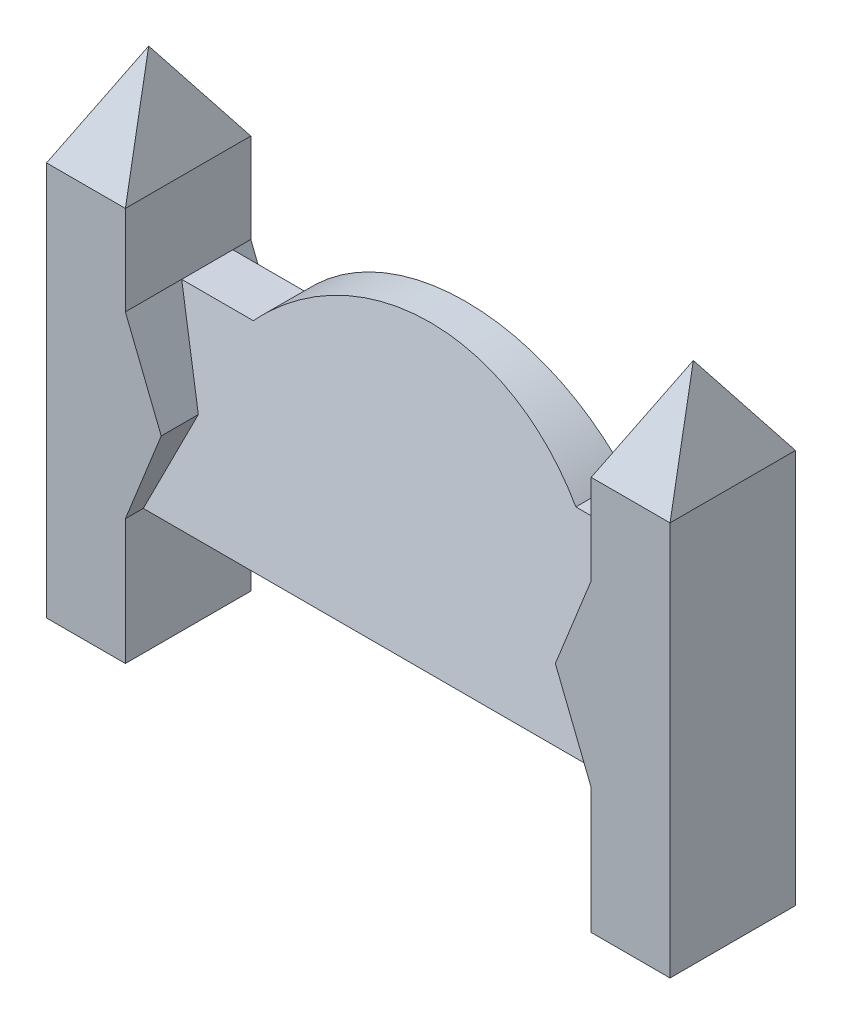
ISO-10303-21;
HEADER;
FILE_DESCRIPTION(('STEP AP214'),'2;1');
FILE_NAME('part.step','',(''),(''),'','','');
FILE_SCHEMA(('AUTOMOTIVE_DESIGN { 1 0 10303 214 1 1 1 1 }'));
ENDSEC;
DATA;
#1=APPLICATION_CONTEXT('core data for automotive mechanical design processes');
#2=APPLICATION_PROTOCOL_DEFINITION('international standard','automotive_design',2000,#1);
#3=PRODUCT_CONTEXT('',#1,'mechanical');
#4=PRODUCT('Part','Part','',(#3));
#5=PRODUCT_RELATED_PRODUCT_CATEGORY('part','',(#4));
#6=PRODUCT_DEFINITION_FORMATION('','',#4);
#7=PRODUCT_DEFINITION_CONTEXT('part definition',#1,'design');
#8=PRODUCT_DEFINITION('design','',#6,#7);
#9=PRODUCT_DEFINITION_SHAPE('','',#8);
#10=(LENGTH_UNIT() NAMED_UNIT(*) SI_UNIT(.MILLI.,.METRE.));
#11=(NAMED_UNIT(*) PLANE_ANGLE_UNIT() SI_UNIT($,.RADIAN.));
#12=(NAMED_UNIT(*) SI_UNIT($,.STERADIAN.) SOLID_ANGLE_UNIT());
#13=UNCERTAINTY_MEASURE_WITH_UNIT(LENGTH_MEASURE(1.E-05),#10,'distance_accuracy_value','');
#14=(GEOMETRIC_REPRESENTATION_CONTEXT(3) GLOBAL_UNCERTAINTY_ASSIGNED_CONTEXT((#13)) GLOBAL_UNIT_ASSIGNED_CONTEXT((#10,
#11,#12)) REPRESENTATION_CONTEXT('',''));
#15=CARTESIAN_POINT('',(0.,0.,0.));
#16=DIRECTION('',(0.,0.,1.));
#17=DIRECTION('',(1.,0.,0.));
#18=AXIS2_PLACEMENT_3D('',#15,#16,#17);
#19=CARTESIAN_POINT('',(1520.,1050.,50.));
#20=DIRECTION('',(0.,0.,-1.));
#21=DIRECTION('',(0.,1.,0.));
#22=AXIS2_PLACEMENT_3D('',#19,#20,#21);
#23=PLANE('',#22);
#24=CARTESIAN_POINT('',(870.,443.749999999999,50.));
#25=DIRECTION('',(0.,0.,-1.));
#26=DIRECTION('',(0.,1.,0.));
#27=AXIS2_PLACEMENT_3D('',#24,#25,#26);
#28=CIRCLE('',#27,606.250000000001);
#29=CARTESIAN_POINT('',(420.,850.,50.));
#30=VERTEX_POINT('',#29);
#31=CARTESIAN_POINT('',(1320.,850.,50.));
#32=VERTEX_POINT('',#31);
#33=EDGE_CURVE('E641',#30,#32,#28,.T.);
#34=ORIENTED_EDGE('',*,*,#33,.T.);
#35=DIRECTION('',(1.,0.,0.));
#36=VECTOR('',#35,1.);
#37=CARTESIAN_POINT('',(1520.,850.,50.));
#38=LINE('',#37,#36);
#39=CARTESIAN_POINT('',(1520.,850.,50.));
#40=VERTEX_POINT('',#39);
#41=EDGE_CURVE('E665',#32,#40,#38,.T.);
#42=ORIENTED_EDGE('',*,*,#41,.T.);
#43=DIRECTION('',(-0.371390676354104,-0.928476690885259,0.));
#44=VECTOR('',#43,1.);
#45=CARTESIAN_POINT('',(1588.96551724138,1022.41379310345,50.));
#46=LINE('',#45,#44);
#47=CARTESIAN_POINT('',(1420.,600.,50.));
#48=VERTEX_POINT('',#47);
#49=EDGE_CURVE('E247',#40,#48,#46,.T.);
#50=ORIENTED_EDGE('',*,*,#49,.T.);
#51=DIRECTION('',(0.371390676354104,-0.928476690885259,0.));
#52=VECTOR('',#51,1.);
#53=CARTESIAN_POINT('',(1278.62068965517,953.448275862069,50.));
#54=LINE('',#53,#52);
#55=CARTESIAN_POINT('',(1520.,350.,50.));
#56=VERTEX_POINT('',#55);
#57=EDGE_CURVE('E241',#48,#56,#54,.T.);
#58=ORIENTED_EDGE('',*,*,#57,.T.);
#59=DIRECTION('',(-1.,0.,0.));
#60=VECTOR('',#59,1.);
#61=CARTESIAN_POINT('',(1520.,350.,50.0000000000001));
#62=LINE('',#61,#60);
#63=CARTESIAN_POINT('',(220.,350.,50.0000000000001));
#64=VERTEX_POINT('',#63);
#65=EDGE_CURVE('E254',#56,#64,#62,.T.);
#66=ORIENTED_EDGE('',*,*,#65,.T.);
#67=DIRECTION('',(-0.371390676354104,-0.928476690885259,0.));
#68=VECTOR('',#67,1.);
#69=CARTESIAN_POINT('',(320.,600.,50.));
#70=LINE('',#69,#68);
#71=CARTESIAN_POINT('',(320.,600.,50.));
#72=VERTEX_POINT('',#71);
#73=EDGE_CURVE('E268',#72,#64,#70,.T.);
#74=ORIENTED_EDGE('',*,*,#73,.F.);
#75=DIRECTION('',(0.371390676354104,-0.928476690885259,0.));
#76=VECTOR('',#75,1.);
#77=CARTESIAN_POINT('',(220.,850.,50.));
#78=LINE('',#77,#76);
#79=CARTESIAN_POINT('',(220.,850.,50.));
#80=VERTEX_POINT('',#79);
#81=EDGE_CURVE('E265',#80,#72,#78,.T.);
#82=ORIENTED_EDGE('',*,*,#81,.F.);
#83=DIRECTION('',(1.,0.,0.));
#84=VECTOR('',#83,1.);
#85=CARTESIAN_POINT('',(1520.,850.,50.));
#86=LINE('',#85,#84);
#87=EDGE_CURVE('E355',#80,#30,#86,.T.);
#88=ORIENTED_EDGE('',*,*,#87,.T.);
#89=EDGE_LOOP('',(#34,#42,#50,#58,#66,#74,#82,#88));
#90=FACE_BOUND('',#89,.T.);
#91=ADVANCED_FACE('F38',(#90),#23,.T.);
#92=CARTESIAN_POINT('',(1520.,350.,300.));
#93=DIRECTION('',(0.,0.209529088730874,0.977802414077409));
#94=DIRECTION('',(0.,-0.97780241407741,0.209529088730874));
#95=AXIS2_PLACEMENT_3D('',#92,#93,#94);
#96=PLANE('',#95);
#97=DIRECTION('',(0.364251237872651,0.910628094681627,-0.195134591717492));
#98=VECTOR('',#97,1.);
#99=CARTESIAN_POINT('',(1346.53579285835,416.339482145879,285.784396683026));
#100=LINE('',#99,#98);
#101=CARTESIAN_POINT('',(1420.,600.,246.428571428571));
#102=VERTEX_POINT('',#101);
#103=CARTESIAN_POINT('',(1520.,850.,192.857142857143));
#104=VERTEX_POINT('',#103);
#105=EDGE_CURVE('E244',#102,#104,#100,.T.);
#106=ORIENTED_EDGE('',*,*,#105,.T.);
#107=DIRECTION('',(-1.,0.,0.));
#108=VECTOR('',#107,1.);
#109=CARTESIAN_POINT('',(1520.,850.,192.857142857143));
#110=LINE('',#109,#108);
#111=CARTESIAN_POINT('',(1320.,850.,192.857142857143));
#112=VERTEX_POINT('',#111);
#113=EDGE_CURVE('E663',#104,#112,#110,.T.);
#114=ORIENTED_EDGE('',*,*,#113,.T.);
#115=CARTESIAN_POINT('',(870.,443.749999999999,279.910714285714));
#116=DIRECTION('',(0.,0.209529088730874,0.977802414077409));
#117=DIRECTION('',(0.,0.97780241407741,-0.209529088730874));
#118=AXIS2_PLACEMENT_3D('',#115,#116,#117);
#119=ELLIPSE('',#118,620.012787115093,606.250000000001);
#120=CARTESIAN_POINT('',(420.,850.,192.857142857143));
#121=VERTEX_POINT('',#120);
#122=EDGE_CURVE('E640',#112,#121,#119,.T.);
#123=ORIENTED_EDGE('',*,*,#122,.T.);
#124=DIRECTION('',(-1.,0.,0.));
#125=VECTOR('',#124,1.);
#126=CARTESIAN_POINT('',(1520.,850.,192.857142857143));
#127=LINE('',#126,#125);
#128=CARTESIAN_POINT('',(220.,850.,192.857142857143));
#129=VERTEX_POINT('',#128);
#130=EDGE_CURVE('E628',#121,#129,#127,.T.);
#131=ORIENTED_EDGE('',*,*,#130,.T.);
#132=DIRECTION('',(-0.364251237872651,0.910628094681627,-0.195134591717492));
#133=VECTOR('',#132,1.);
#134=CARTESIAN_POINT('',(231.169402606194,822.076493484515,198.840751396175));
#135=LINE('',#134,#133);
#136=CARTESIAN_POINT('',(320.,600.,246.428571428571));
#137=VERTEX_POINT('',#136);
#138=EDGE_CURVE('E258',#137,#129,#135,.T.);
#139=ORIENTED_EDGE('',*,*,#138,.F.);
#140=DIRECTION('',(0.364251237872651,0.910628094681627,-0.195134591717492));
#141=VECTOR('',#140,1.);
#142=CARTESIAN_POINT('',(312.638348282281,581.595870705703,250.372313420206));
#143=LINE('',#142,#141);
#144=CARTESIAN_POINT('',(220.,350.,300.));
#145=VERTEX_POINT('',#144);
#146=EDGE_CURVE('E262',#145,#137,#143,.T.);
#147=ORIENTED_EDGE('',*,*,#146,.F.);
#148=DIRECTION('',(-1.,0.,0.));
#149=VECTOR('',#148,1.);
#150=CARTESIAN_POINT('',(1520.,350.,300.));
#151=LINE('',#150,#149);
#152=CARTESIAN_POINT('',(1520.,350.,300.));
#153=VERTEX_POINT('',#152);
#154=EDGE_CURVE('E255',#153,#145,#151,.T.);
#155=ORIENTED_EDGE('',*,*,#154,.F.);
#156=DIRECTION('',(-0.364251237872651,0.910628094681627,-0.195134591717492));
#157=VECTOR('',#156,1.);
#158=CARTESIAN_POINT('',(1520.,350.,300.));
#159=LINE('',#158,#157);
#160=EDGE_CURVE('E238',#153,#102,#159,.T.);
#161=ORIENTED_EDGE('',*,*,#160,.T.);
#162=EDGE_LOOP('',(#106,#114,#123,#131,#139,#147,#155,#161));
#163=FACE_BOUND('',#162,.T.);
#164=ADVANCED_FACE('F409',(#163),#96,.T.);
#165=CARTESIAN_POINT('',(320.,600.,350.));
#166=DIRECTION('',(-0.928476690885259,0.371390676354104,0.));
#167=DIRECTION('',(-0.371390676354104,-0.928476690885259,0.));
#168=AXIS2_PLACEMENT_3D('',#165,#166,#167);
#169=PLANE('',#168);
#170=DIRECTION('',(0.,0.,-1.));
#171=VECTOR('',#170,1.);
#172=CARTESIAN_POINT('',(320.,600.,350.));
#173=LINE('',#172,#171);
#174=CARTESIAN_POINT('',(320.,600.,0.));
#175=VERTEX_POINT('',#174);
#176=EDGE_CURVE('E297',#72,#175,#173,.T.);
#177=ORIENTED_EDGE('',*,*,#176,.F.);
#178=ORIENTED_EDGE('',*,*,#73,.T.);
#179=DIRECTION('',(0.,0.,-1.));
#180=VECTOR('',#179,1.);
#181=CARTESIAN_POINT('',(220.,350.,350.));
#182=LINE('',#181,#180);
#183=CARTESIAN_POINT('',(220.,350.,0.));
#184=VERTEX_POINT('',#183);
#185=EDGE_CURVE('E302',#64,#184,#182,.T.);
#186=ORIENTED_EDGE('',*,*,#185,.T.);
#187=DIRECTION('',(0.371390676354104,0.928476690885259,0.));
#188=VECTOR('',#187,1.);
#189=CARTESIAN_POINT('',(320.,600.,0.));
#190=LINE('',#189,#188);
#191=EDGE_CURVE('E277',#184,#175,#190,.T.);
#192=ORIENTED_EDGE('',*,*,#191,.T.);
#193=EDGE_LOOP('',(#177,#178,#186,#192));
#194=FACE_BOUND('',#193,.T.);
#195=ADVANCED_FACE('F415',(#194),#169,.F.);
#196=CARTESIAN_POINT('',(220.,850.,350.));
#197=DIRECTION('',(-0.928476690885259,-0.371390676354104,0.));
#198=DIRECTION('',(0.371390676354104,-0.928476690885259,0.));
#199=AXIS2_PLACEMENT_3D('',#196,#197,#198);
#200=PLANE('',#199);
#201=DIRECTION('',(0.,0.,-1.));
#202=VECTOR('',#201,1.);
#203=CARTESIAN_POINT('',(220.,850.,350.));
#204=LINE('',#203,#202);
#205=CARTESIAN_POINT('',(220.,850.,0.));
#206=VERTEX_POINT('',#205);
#207=EDGE_CURVE('E298',#80,#206,#204,.T.);
#208=ORIENTED_EDGE('',*,*,#207,.F.);
#209=ORIENTED_EDGE('',*,*,#81,.T.);
#210=ORIENTED_EDGE('',*,*,#176,.T.);
#211=DIRECTION('',(-0.371390676354104,0.928476690885259,0.));
#212=VECTOR('',#211,1.);
#213=CARTESIAN_POINT('',(220.,850.,0.));
#214=LINE('',#213,#212);
#215=EDGE_CURVE('E280',#175,#206,#214,.T.);
#216=ORIENTED_EDGE('',*,*,#215,.T.);
#217=EDGE_LOOP('',(#208,#209,#210,#216));
#218=FACE_BOUND('',#217,.T.);
#219=ADVANCED_FACE('F436',(#218),#200,.F.);
#220=CARTESIAN_POINT('',(0.,0.,350.));
#221=DIRECTION('',(1.,0.,0.));
#222=DIRECTION('',(0.,0.,-1.));
#223=AXIS2_PLACEMENT_3D('',#220,#221,#222);
#224=PLANE('',#223);
#225=DIRECTION('',(0.,-1.,0.));
#226=VECTOR('',#225,1.);
#227=CARTESIAN_POINT('',(0.,0.,0.));
#228=LINE('',#227,#226);
#229=CARTESIAN_POINT('',(0.,1100.,0.));
#230=VERTEX_POINT('',#229);
#231=CARTESIAN_POINT('',(0.,0.,0.));
#232=VERTEX_POINT('',#231);
#233=EDGE_CURVE('E271',#230,#232,#228,.T.);
#234=ORIENTED_EDGE('',*,*,#233,.T.);
#235=DIRECTION('',(0.,0.,-1.));
#236=VECTOR('',#235,1.);
#237=CARTESIAN_POINT('',(0.,0.,350.));
#238=LINE('',#237,#236);
#239=CARTESIAN_POINT('',(0.,0.,350.));
#240=VERTEX_POINT('',#239);
#241=EDGE_CURVE('E12',#240,#232,#238,.T.);
#242=ORIENTED_EDGE('',*,*,#241,.F.);
#243=DIRECTION('',(0.,-1.,0.));
#244=VECTOR('',#243,1.);
#245=CARTESIAN_POINT('',(0.,0.,350.));
#246=LINE('',#245,#244);
#247=CARTESIAN_POINT('',(0.,1100.,350.));
#248=VERTEX_POINT('',#247);
#249=EDGE_CURVE('E287',#248,#240,#246,.T.);
#250=ORIENTED_EDGE('',*,*,#249,.F.);
#251=DIRECTION('',(0.,0.,-1.));
#252=VECTOR('',#251,1.);
#253=CARTESIAN_POINT('',(0.,1100.,350.));
#254=LINE('',#253,#252);
#255=EDGE_CURVE('E313',#248,#230,#254,.T.);
#256=ORIENTED_EDGE('',*,*,#255,.T.);
#257=EDGE_LOOP('',(#234,#242,#250,#256));
#258=FACE_BOUND('',#257,.T.);
#259=ADVANCED_FACE('F40',(#258),#224,.F.);
#260=CARTESIAN_POINT('',(0.,0.,350.));
#261=DIRECTION('',(0.,1.,0.));
#262=DIRECTION('',(0.,0.,1.));
#263=AXIS2_PLACEMENT_3D('',#260,#261,#262);
#264=PLANE('',#263);
#265=DIRECTION('',(1.,0.,0.));
#266=VECTOR('',#265,1.);
#267=CARTESIAN_POINT('',(0.,0.,0.));
#268=LINE('',#267,#266);
#269=CARTESIAN_POINT('',(220.,0.,0.));
#270=VERTEX_POINT('',#269);
#271=EDGE_CURVE('E272',#232,#270,#268,.T.);
#272=ORIENTED_EDGE('',*,*,#271,.T.);
#273=DIRECTION('',(0.,0.,-1.));
#274=VECTOR('',#273,1.);
#275=CARTESIAN_POINT('',(220.,0.,350.));
#276=LINE('',#275,#274);
#277=CARTESIAN_POINT('',(220.,0.,350.));
#278=VERTEX_POINT('',#277);
#279=EDGE_CURVE('E48',#278,#270,#276,.T.);
#280=ORIENTED_EDGE('',*,*,#279,.F.);
#281=DIRECTION('',(1.,0.,0.));
#282=VECTOR('',#281,1.);
#283=CARTESIAN_POINT('',(0.,0.,350.));
#284=LINE('',#283,#282);
#285=EDGE_CURVE('E284',#240,#278,#284,.T.);
#286=ORIENTED_EDGE('',*,*,#285,.F.);
#287=ORIENTED_EDGE('',*,*,#241,.T.);
#288=EDGE_LOOP('',(#272,#280,#286,#287));
#289=FACE_BOUND('',#288,.T.);
#290=ADVANCED_FACE('F442',(#289),#264,.F.);
#291=CARTESIAN_POINT('',(220.,0.,350.));
#292=DIRECTION('',(-1.,0.,0.));
#293=DIRECTION('',(0.,0.,1.));
#294=AXIS2_PLACEMENT_3D('',#291,#292,#293);
#295=PLANE('',#294);
#296=DIRECTION('',(0.,1.,0.));
#297=VECTOR('',#296,1.);
#298=CARTESIAN_POINT('',(220.,0.,0.));
#299=LINE('',#298,#297);
#300=EDGE_CURVE('E274',#270,#184,#299,.T.);
#301=ORIENTED_EDGE('',*,*,#300,.T.);
#302=ORIENTED_EDGE('',*,*,#185,.F.);
#303=DIRECTION('',(0.,0.,1.));
#304=VECTOR('',#303,1.);
#305=CARTESIAN_POINT('',(220.,350.,50.0000000000001));
#306=LINE('',#305,#304);
#307=EDGE_CURVE('E250',#64,#145,#306,.T.);
#308=ORIENTED_EDGE('',*,*,#307,.T.);
#309=CARTESIAN_POINT('',(220.,350.,350.));
#310=VERTEX_POINT('',#309);
#311=EDGE_CURVE('E303',#310,#145,#182,.T.);
#312=ORIENTED_EDGE('',*,*,#311,.F.);
#313=DIRECTION('',(0.,1.,0.));
#314=VECTOR('',#313,1.);
#315=CARTESIAN_POINT('',(220.,0.,350.));
#316=LINE('',#315,#314);
#317=EDGE_CURVE('E286',#278,#310,#316,.T.);
#318=ORIENTED_EDGE('',*,*,#317,.F.);
#319=ORIENTED_EDGE('',*,*,#279,.T.);
#320=EDGE_LOOP('',(#301,#302,#308,#312,#318,#319));
#321=FACE_BOUND('',#320,.T.);
#322=ADVANCED_FACE('F439',(#321),#295,.F.);
#323=ORIENTED_EDGE('',*,*,#311,.T.);
#324=ORIENTED_EDGE('',*,*,#146,.T.);
#325=CARTESIAN_POINT('',(320.,600.,350.));
#326=VERTEX_POINT('',#325);
#327=EDGE_CURVE('E299',#326,#137,#173,.T.);
#328=ORIENTED_EDGE('',*,*,#327,.F.);
#329=DIRECTION('',(0.371390676354104,0.928476690885259,0.));
#330=VECTOR('',#329,1.);
#331=CARTESIAN_POINT('',(320.,600.,350.));
#332=LINE('',#331,#330);
#333=EDGE_CURVE('E289',#310,#326,#332,.T.);
#334=ORIENTED_EDGE('',*,*,#333,.F.);
#335=EDGE_LOOP('',(#323,#324,#328,#334));
#336=FACE_BOUND('',#335,.T.);
#337=ADVANCED_FACE('F434',(#336),#169,.F.);
#338=ORIENTED_EDGE('',*,*,#327,.T.);
#339=ORIENTED_EDGE('',*,*,#138,.T.);
#340=CARTESIAN_POINT('',(220.,850.,350.));
#341=VERTEX_POINT('',#340);
#342=EDGE_CURVE('E294',#341,#129,#204,.T.);
#343=ORIENTED_EDGE('',*,*,#342,.F.);
#344=DIRECTION('',(-0.371390676354104,0.928476690885259,0.));
#345=VECTOR('',#344,1.);
#346=CARTESIAN_POINT('',(220.,850.,350.));
#347=LINE('',#346,#345);
#348=EDGE_CURVE('E291',#326,#341,#347,.T.);
#349=ORIENTED_EDGE('',*,*,#348,.F.);
#350=EDGE_LOOP('',(#338,#339,#343,#349));
#351=FACE_BOUND('',#350,.T.);
#352=ADVANCED_FACE('F430',(#351),#200,.F.);
#353=CARTESIAN_POINT('',(220.,850.,350.));
#354=DIRECTION('',(-1.,0.,0.));
#355=DIRECTION('',(0.,0.,1.));
#356=AXIS2_PLACEMENT_3D('',#353,#354,#355);
#357=PLANE('',#356);
#358=DIRECTION('',(0.,0.,-1.));
#359=VECTOR('',#358,1.);
#360=CARTESIAN_POINT('',(220.,850.,350.));
#361=LINE('',#360,#359);
#362=EDGE_CURVE('E624',#129,#80,#361,.T.);
#363=ORIENTED_EDGE('',*,*,#362,.T.);
#364=ORIENTED_EDGE('',*,*,#207,.T.);
#365=DIRECTION('',(0.,1.,0.));
#366=VECTOR('',#365,1.);
#367=CARTESIAN_POINT('',(220.,850.,0.));
#368=LINE('',#367,#366);
#369=CARTESIAN_POINT('',(220.,1100.,0.));
#370=VERTEX_POINT('',#369);
#371=EDGE_CURVE('E283',#206,#370,#368,.T.);
#372=ORIENTED_EDGE('',*,*,#371,.T.);
#373=DIRECTION('',(0.,0.,1.));
#374=VECTOR('',#373,1.);
#375=CARTESIAN_POINT('',(220.,1100.,175.));
#376=LINE('',#375,#374);
#377=CARTESIAN_POINT('',(220.,1100.,350.));
#378=VERTEX_POINT('',#377);
#379=EDGE_CURVE('E315',#378,#370,#376,.F.);
#380=ORIENTED_EDGE('',*,*,#379,.F.);
#381=DIRECTION('',(0.,1.,0.));
#382=VECTOR('',#381,1.);
#383=CARTESIAN_POINT('',(220.,850.,350.));
#384=LINE('',#383,#382);
#385=EDGE_CURVE('E293',#341,#378,#384,.T.);
#386=ORIENTED_EDGE('',*,*,#385,.F.);
#387=ORIENTED_EDGE('',*,*,#342,.T.);
#388=EDGE_LOOP('',(#363,#364,#372,#380,#386,#387));
#389=FACE_BOUND('',#388,.T.);
#390=ADVANCED_FACE('F427',(#389),#357,.F.);
#391=CARTESIAN_POINT('',(0.,1100.,350.));
#392=DIRECTION('',(0.,0.,-1.));
#393=DIRECTION('',(-1.,0.,0.));
#394=AXIS2_PLACEMENT_3D('',#391,#392,#393);
#395=PLANE('',#394);
#396=ORIENTED_EDGE('',*,*,#249,.T.);
#397=ORIENTED_EDGE('',*,*,#285,.T.);
#398=ORIENTED_EDGE('',*,*,#317,.T.);
#399=ORIENTED_EDGE('',*,*,#333,.T.);
#400=ORIENTED_EDGE('',*,*,#348,.T.);
#401=ORIENTED_EDGE('',*,*,#385,.T.);
#402=DIRECTION('',(-1.,0.,0.));
#403=VECTOR('',#402,1.);
#404=CARTESIAN_POINT('',(0.,1100.,350.));
#405=LINE('',#404,#403);
#406=EDGE_CURVE('E57',#378,#248,#405,.T.);
#407=ORIENTED_EDGE('',*,*,#406,.T.);
#408=EDGE_LOOP('',(#396,#397,#398,#399,#400,#401,#407));
#409=FACE_BOUND('',#408,.T.);
#410=ADVANCED_FACE('F424',(#409),#395,.F.);
#411=CARTESIAN_POINT('',(0.,1100.,0.));
#412=DIRECTION('',(0.,0.,-1.));
#413=DIRECTION('',(-1.,0.,0.));
#414=AXIS2_PLACEMENT_3D('',#411,#412,#413);
#415=PLANE('',#414);
#416=ORIENTED_EDGE('',*,*,#233,.F.);
#417=DIRECTION('',(1.,0.,0.));
#418=VECTOR('',#417,1.);
#419=CARTESIAN_POINT('',(0.,1100.,0.));
#420=LINE('',#419,#418);
#421=EDGE_CURVE('E169',#370,#230,#420,.F.);
#422=ORIENTED_EDGE('',*,*,#421,.F.);
#423=ORIENTED_EDGE('',*,*,#371,.F.);
#424=ORIENTED_EDGE('',*,*,#215,.F.);
#425=ORIENTED_EDGE('',*,*,#191,.F.);
#426=ORIENTED_EDGE('',*,*,#300,.F.);
#427=ORIENTED_EDGE('',*,*,#271,.F.);
#428=EDGE_LOOP('',(#416,#422,#423,#424,#425,#426,#427));
#429=FACE_BOUND('',#428,.T.);
#430=ADVANCED_FACE('F421',(#429),#415,.T.);
#431=CARTESIAN_POINT('',(1520.,350.,50.0000000000001));
#432=DIRECTION('',(0.,-1.,0.));
#433=DIRECTION('',(0.,0.,-1.));
#434=AXIS2_PLACEMENT_3D('',#431,#432,#433);
#435=PLANE('',#434);
#436=ORIENTED_EDGE('',*,*,#307,.F.);
#437=ORIENTED_EDGE('',*,*,#65,.F.);
#438=DIRECTION('',(0.,0.,1.));
#439=VECTOR('',#438,1.);
#440=CARTESIAN_POINT('',(1520.,350.,50.0000000000001));
#441=LINE('',#440,#439);
#442=EDGE_CURVE('E196',#56,#153,#441,.T.);
#443=ORIENTED_EDGE('',*,*,#442,.T.);
#444=ORIENTED_EDGE('',*,*,#154,.T.);
#445=EDGE_LOOP('',(#436,#437,#443,#444));
#446=FACE_BOUND('',#445,.T.);
#447=ADVANCED_FACE('F420',(#446),#435,.T.);
#448=CARTESIAN_POINT('',(1520.,850.,350.));
#449=DIRECTION('',(0.928476690885259,-0.371390676354104,0.));
#450=DIRECTION('',(0.371390676354104,0.928476690885259,0.));
#451=AXIS2_PLACEMENT_3D('',#448,#449,#450);
#452=PLANE('',#451);
#453=ORIENTED_EDGE('',*,*,#49,.F.);
#454=DIRECTION('',(0.,0.,-1.));
#455=VECTOR('',#454,1.);
#456=CARTESIAN_POINT('',(1520.,850.,350.));
#457=LINE('',#456,#455);
#458=CARTESIAN_POINT('',(1520.,850.,0.));
#459=VERTEX_POINT('',#458);
#460=EDGE_CURVE('E233',#40,#459,#457,.T.);
#461=ORIENTED_EDGE('',*,*,#460,.T.);
#462=DIRECTION('',(-0.371390676354104,-0.928476690885259,0.));
#463=VECTOR('',#462,1.);
#464=CARTESIAN_POINT('',(1520.,850.,0.));
#465=LINE('',#464,#463);
#466=CARTESIAN_POINT('',(1420.,600.,0.));
#467=VERTEX_POINT('',#466);
#468=EDGE_CURVE('E210',#459,#467,#465,.T.);
#469=ORIENTED_EDGE('',*,*,#468,.T.);
#470=DIRECTION('',(0.,0.,-1.));
#471=VECTOR('',#470,1.);
#472=CARTESIAN_POINT('',(1420.,600.,350.));
#473=LINE('',#472,#471);
#474=EDGE_CURVE('E206',#48,#467,#473,.T.);
#475=ORIENTED_EDGE('',*,*,#474,.F.);
#476=EDGE_LOOP('',(#453,#461,#469,#475));
#477=FACE_BOUND('',#476,.T.);
#478=ADVANCED_FACE('F366',(#477),#452,.F.);
#479=CARTESIAN_POINT('',(1420.,600.,350.));
#480=DIRECTION('',(0.928476690885259,0.371390676354104,0.));
#481=DIRECTION('',(-0.371390676354104,0.928476690885259,0.));
#482=AXIS2_PLACEMENT_3D('',#479,#480,#481);
#483=PLANE('',#482);
#484=ORIENTED_EDGE('',*,*,#57,.F.);
#485=ORIENTED_EDGE('',*,*,#474,.T.);
#486=DIRECTION('',(0.371390676354104,-0.928476690885259,0.));
#487=VECTOR('',#486,1.);
#488=CARTESIAN_POINT('',(1420.,600.,0.));
#489=LINE('',#488,#487);
#490=CARTESIAN_POINT('',(1520.,350.,0.));
#491=VERTEX_POINT('',#490);
#492=EDGE_CURVE('E203',#467,#491,#489,.T.);
#493=ORIENTED_EDGE('',*,*,#492,.T.);
#494=DIRECTION('',(0.,0.,-1.));
#495=VECTOR('',#494,1.);
#496=CARTESIAN_POINT('',(1520.,350.,350.));
#497=LINE('',#496,#495);
#498=EDGE_CURVE('E189',#56,#491,#497,.T.);
#499=ORIENTED_EDGE('',*,*,#498,.F.);
#500=EDGE_LOOP('',(#484,#485,#493,#499));
#501=FACE_BOUND('',#500,.T.);
#502=ADVANCED_FACE('F204',(#501),#483,.F.);
#503=CARTESIAN_POINT('',(1740.,0.,350.));
#504=DIRECTION('',(-1.,0.,0.));
#505=DIRECTION('',(0.,0.,1.));
#506=AXIS2_PLACEMENT_3D('',#503,#504,#505);
#507=PLANE('',#506);
#508=DIRECTION('',(0.,1.,0.));
#509=VECTOR('',#508,1.);
#510=CARTESIAN_POINT('',(1740.,0.,0.));
#511=LINE('',#510,#509);
#512=CARTESIAN_POINT('',(1740.,0.,0.));
#513=VERTEX_POINT('',#512);
#514=CARTESIAN_POINT('',(1740.,1100.,0.));
#515=VERTEX_POINT('',#514);
#516=EDGE_CURVE('E319',#513,#515,#511,.T.);
#517=ORIENTED_EDGE('',*,*,#516,.T.);
#518=DIRECTION('',(0.,0.,1.));
#519=VECTOR('',#518,1.);
#520=CARTESIAN_POINT('',(1740.,1100.,175.));
#521=LINE('',#520,#519);
#522=CARTESIAN_POINT('',(1740.,1100.,350.));
#523=VERTEX_POINT('',#522);
#524=EDGE_CURVE('E242',#523,#515,#521,.F.);
#525=ORIENTED_EDGE('',*,*,#524,.F.);
#526=DIRECTION('',(0.,1.,0.));
#527=VECTOR('',#526,1.);
#528=CARTESIAN_POINT('',(1740.,0.,350.));
#529=LINE('',#528,#527);
#530=CARTESIAN_POINT('',(1740.,0.,350.));
#531=VERTEX_POINT('',#530);
#532=EDGE_CURVE('E79',#531,#523,#529,.T.);
#533=ORIENTED_EDGE('',*,*,#532,.F.);
#534=DIRECTION('',(0.,0.,-1.));
#535=VECTOR('',#534,1.);
#536=CARTESIAN_POINT('',(1740.,0.,350.));
#537=LINE('',#536,#535);
#538=EDGE_CURVE('E227',#531,#513,#537,.T.);
#539=ORIENTED_EDGE('',*,*,#538,.T.);
#540=EDGE_LOOP('',(#517,#525,#533,#539));
#541=FACE_BOUND('',#540,.T.);
#542=ADVANCED_FACE('F398',(#541),#507,.F.);
#543=CARTESIAN_POINT('',(1520.,850.,350.));
#544=DIRECTION('',(1.,0.,0.));
#545=DIRECTION('',(0.,0.,-1.));
#546=AXIS2_PLACEMENT_3D('',#543,#544,#545);
#547=PLANE('',#546);
#548=ORIENTED_EDGE('',*,*,#460,.F.);
#549=DIRECTION('',(0.,0.,-1.));
#550=VECTOR('',#549,1.);
#551=CARTESIAN_POINT('',(1520.,850.,350.));
#552=LINE('',#551,#550);
#553=EDGE_CURVE('E385',#104,#40,#552,.T.);
#554=ORIENTED_EDGE('',*,*,#553,.F.);
#555=CARTESIAN_POINT('',(1520.,850.,350.));
#556=VERTEX_POINT('',#555);
#557=EDGE_CURVE('E234',#556,#104,#457,.T.);
#558=ORIENTED_EDGE('',*,*,#557,.F.);
#559=DIRECTION('',(0.,-1.,0.));
#560=VECTOR('',#559,1.);
#561=CARTESIAN_POINT('',(1520.,850.,350.));
#562=LINE('',#561,#560);
#563=CARTESIAN_POINT('',(1520.,1100.,350.));
#564=VERTEX_POINT('',#563);
#565=EDGE_CURVE('E221',#564,#556,#562,.T.);
#566=ORIENTED_EDGE('',*,*,#565,.F.);
#567=DIRECTION('',(0.,0.,-1.));
#568=VECTOR('',#567,1.);
#569=CARTESIAN_POINT('',(1520.,1100.,350.));
#570=LINE('',#569,#568);
#571=CARTESIAN_POINT('',(1520.,1100.,0.));
#572=VERTEX_POINT('',#571);
#573=EDGE_CURVE('E237',#564,#572,#570,.T.);
#574=ORIENTED_EDGE('',*,*,#573,.T.);
#575=DIRECTION('',(0.,-1.,0.));
#576=VECTOR('',#575,1.);
#577=CARTESIAN_POINT('',(1520.,850.,0.));
#578=LINE('',#577,#576);
#579=EDGE_CURVE('E324',#572,#459,#578,.T.);
#580=ORIENTED_EDGE('',*,*,#579,.T.);
#581=EDGE_LOOP('',(#548,#554,#558,#566,#574,#580));
#582=FACE_BOUND('',#581,.T.);
#583=ADVANCED_FACE('F380',(#582),#547,.F.);
#584=ORIENTED_EDGE('',*,*,#105,.F.);
#585=CARTESIAN_POINT('',(1420.,600.,350.));
#586=VERTEX_POINT('',#585);
#587=EDGE_CURVE('E230',#586,#102,#473,.T.);
#588=ORIENTED_EDGE('',*,*,#587,.F.);
#589=DIRECTION('',(-0.371390676354104,-0.928476690885259,0.));
#590=VECTOR('',#589,1.);
#591=CARTESIAN_POINT('',(1520.,850.,350.));
#592=LINE('',#591,#590);
#593=EDGE_CURVE('E218',#556,#586,#592,.T.);
#594=ORIENTED_EDGE('',*,*,#593,.F.);
#595=ORIENTED_EDGE('',*,*,#557,.T.);
#596=EDGE_LOOP('',(#584,#588,#594,#595));
#597=FACE_BOUND('',#596,.T.);
#598=ADVANCED_FACE('F388',(#597),#452,.F.);
#599=ORIENTED_EDGE('',*,*,#160,.F.);
#600=CARTESIAN_POINT('',(1520.,350.,350.));
#601=VERTEX_POINT('',#600);
#602=EDGE_CURVE('E199',#601,#153,#497,.T.);
#603=ORIENTED_EDGE('',*,*,#602,.F.);
#604=DIRECTION('',(0.371390676354104,-0.928476690885259,0.));
#605=VECTOR('',#604,1.);
#606=CARTESIAN_POINT('',(1420.,600.,350.));
#607=LINE('',#606,#605);
#608=EDGE_CURVE('E220',#586,#601,#607,.T.);
#609=ORIENTED_EDGE('',*,*,#608,.F.);
#610=ORIENTED_EDGE('',*,*,#587,.T.);
#611=EDGE_LOOP('',(#599,#603,#609,#610));
#612=FACE_BOUND('',#611,.T.);
#613=ADVANCED_FACE('F394',(#612),#483,.F.);
#614=CARTESIAN_POINT('',(1520.,0.,350.));
#615=DIRECTION('',(1.,0.,0.));
#616=DIRECTION('',(0.,0.,-1.));
#617=AXIS2_PLACEMENT_3D('',#614,#615,#616);
#618=PLANE('',#617);
#619=DIRECTION('',(0.,-1.,0.));
#620=VECTOR('',#619,1.);
#621=CARTESIAN_POINT('',(1520.,0.,0.));
#622=LINE('',#621,#620);
#623=CARTESIAN_POINT('',(1520.,0.,0.));
#624=VERTEX_POINT('',#623);
#625=EDGE_CURVE('E194',#491,#624,#622,.T.);
#626=ORIENTED_EDGE('',*,*,#625,.T.);
#627=DIRECTION('',(0.,0.,-1.));
#628=VECTOR('',#627,1.);
#629=CARTESIAN_POINT('',(1520.,0.,350.));
#630=LINE('',#629,#628);
#631=CARTESIAN_POINT('',(1520.,0.,350.));
#632=VERTEX_POINT('',#631);
#633=EDGE_CURVE('E200',#632,#624,#630,.T.);
#634=ORIENTED_EDGE('',*,*,#633,.F.);
#635=DIRECTION('',(0.,-1.,0.));
#636=VECTOR('',#635,1.);
#637=CARTESIAN_POINT('',(1520.,0.,350.));
#638=LINE('',#637,#636);
#639=EDGE_CURVE('E223',#601,#632,#638,.T.);
#640=ORIENTED_EDGE('',*,*,#639,.F.);
#641=ORIENTED_EDGE('',*,*,#602,.T.);
#642=ORIENTED_EDGE('',*,*,#442,.F.);
#643=ORIENTED_EDGE('',*,*,#498,.T.);
#644=EDGE_LOOP('',(#626,#634,#640,#641,#642,#643));
#645=FACE_BOUND('',#644,.T.);
#646=ADVANCED_FACE('F191',(#645),#618,.F.);
#647=CARTESIAN_POINT('',(1740.,0.,350.));
#648=DIRECTION('',(0.,1.,0.));
#649=DIRECTION('',(0.,0.,1.));
#650=AXIS2_PLACEMENT_3D('',#647,#648,#649);
#651=PLANE('',#650);
#652=DIRECTION('',(1.,0.,0.));
#653=VECTOR('',#652,1.);
#654=CARTESIAN_POINT('',(1740.,0.,0.));
#655=LINE('',#654,#653);
#656=EDGE_CURVE('E89',#624,#513,#655,.T.);
#657=ORIENTED_EDGE('',*,*,#656,.T.);
#658=ORIENTED_EDGE('',*,*,#538,.F.);
#659=DIRECTION('',(1.,0.,0.));
#660=VECTOR('',#659,1.);
#661=CARTESIAN_POINT('',(1740.,0.,350.));
#662=LINE('',#661,#660);
#663=EDGE_CURVE('E225',#632,#531,#662,.T.);
#664=ORIENTED_EDGE('',*,*,#663,.F.);
#665=ORIENTED_EDGE('',*,*,#633,.T.);
#666=EDGE_LOOP('',(#657,#658,#664,#665));
#667=FACE_BOUND('',#666,.T.);
#668=ADVANCED_FACE('F397',(#667),#651,.F.);
#669=CARTESIAN_POINT('',(1740.,1100.,350.));
#670=DIRECTION('',(0.,0.,1.));
#671=DIRECTION('',(1.,0.,0.));
#672=AXIS2_PLACEMENT_3D('',#669,#670,#671);
#673=PLANE('',#672);
#674=ORIENTED_EDGE('',*,*,#532,.T.);
#675=DIRECTION('',(1.,0.,0.));
#676=VECTOR('',#675,1.);
#677=CARTESIAN_POINT('',(1740.,1100.,350.));
#678=LINE('',#677,#676);
#679=EDGE_CURVE('E42',#523,#564,#678,.F.);
#680=ORIENTED_EDGE('',*,*,#679,.T.);
#681=ORIENTED_EDGE('',*,*,#565,.T.);
#682=ORIENTED_EDGE('',*,*,#593,.T.);
#683=ORIENTED_EDGE('',*,*,#608,.T.);
#684=ORIENTED_EDGE('',*,*,#639,.T.);
#685=ORIENTED_EDGE('',*,*,#663,.T.);
#686=EDGE_LOOP('',(#674,#680,#681,#682,#683,#684,#685));
#687=FACE_BOUND('',#686,.T.);
#688=ADVANCED_FACE('F378',(#687),#673,.T.);
#689=CARTESIAN_POINT('',(1740.,1100.,0.));
#690=DIRECTION('',(0.,0.,1.));
#691=DIRECTION('',(1.,0.,0.));
#692=AXIS2_PLACEMENT_3D('',#689,#690,#691);
#693=PLANE('',#692);
#694=ORIENTED_EDGE('',*,*,#516,.F.);
#695=ORIENTED_EDGE('',*,*,#656,.F.);
#696=ORIENTED_EDGE('',*,*,#625,.F.);
#697=ORIENTED_EDGE('',*,*,#492,.F.);
#698=ORIENTED_EDGE('',*,*,#468,.F.);
#699=ORIENTED_EDGE('',*,*,#579,.F.);
#700=DIRECTION('',(1.,0.,0.));
#701=VECTOR('',#700,1.);
#702=CARTESIAN_POINT('',(1740.,1100.,0.));
#703=LINE('',#702,#701);
#704=EDGE_CURVE('E321',#515,#572,#703,.F.);
#705=ORIENTED_EDGE('',*,*,#704,.F.);
#706=EDGE_LOOP('',(#694,#695,#696,#697,#698,#699,#705));
#707=FACE_BOUND('',#706,.T.);
#708=ADVANCED_FACE('F213',(#707),#693,.F.);
#709=CARTESIAN_POINT('',(0.,1100.,0.));
#710=DIRECTION('',(0.,-0.573462344363328,0.81923192051904));
#711=DIRECTION('',(0.,-0.819231920519041,-0.573462344363328));
#712=AXIS2_PLACEMENT_3D('',#709,#710,#711);
#713=PLANE('',#712);
#714=DIRECTION('',(0.339104238377561,0.770691450858094,0.539484015600666));
#715=VECTOR('',#714,1.);
#716=CARTESIAN_POINT('',(0.,1100.,0.));
#717=LINE('',#716,#715);
#718=CARTESIAN_POINT('',(110.,1350.,175.));
#719=VERTEX_POINT('',#718);
#720=EDGE_CURVE('E361',#230,#719,#717,.T.);
#721=ORIENTED_EDGE('',*,*,#720,.T.);
#722=DIRECTION('',(-0.339104238377561,0.770691450858094,0.539484015600666));
#723=VECTOR('',#722,1.);
#724=CARTESIAN_POINT('',(220.,1100.,0.));
#725=LINE('',#724,#723);
#726=EDGE_CURVE('E177',#370,#719,#725,.T.);
#727=ORIENTED_EDGE('',*,*,#726,.F.);
#728=ORIENTED_EDGE('',*,*,#421,.T.);
#729=EDGE_LOOP('',(#721,#727,#728));
#730=FACE_BOUND('',#729,.T.);
#731=ADVANCED_FACE('F473',(#730),#713,.F.);
#732=CARTESIAN_POINT('',(110.,1350.,175.));
#733=DIRECTION('',(-0.915315032422766,-0.402738614266017,0.));
#734=DIRECTION('',(0.402738614266017,-0.915315032422766,0.));
#735=AXIS2_PLACEMENT_3D('',#732,#733,#734);
#736=PLANE('',#735);
#737=ORIENTED_EDGE('',*,*,#726,.T.);
#738=DIRECTION('',(-0.339104238377561,0.770691450858094,-0.539484015600666));
#739=VECTOR('',#738,1.);
#740=CARTESIAN_POINT('',(220.,1100.,350.));
#741=LINE('',#740,#739);
#742=EDGE_CURVE('E346',#378,#719,#741,.T.);
#743=ORIENTED_EDGE('',*,*,#742,.F.);
#744=ORIENTED_EDGE('',*,*,#379,.T.);
#745=EDGE_LOOP('',(#737,#743,#744));
#746=FACE_BOUND('',#745,.T.);
#747=ADVANCED_FACE('F475',(#746),#736,.F.);
#748=CARTESIAN_POINT('',(110.,1350.,175.));
#749=DIRECTION('',(0.915315032422766,-0.402738614266017,0.));
#750=DIRECTION('',(0.402738614266017,0.915315032422766,0.));
#751=AXIS2_PLACEMENT_3D('',#748,#749,#750);
#752=PLANE('',#751);
#753=DIRECTION('',(0.339104238377561,0.770691450858094,-0.539484015600666));
#754=VECTOR('',#753,1.);
#755=CARTESIAN_POINT('',(0.,1100.,350.));
#756=LINE('',#755,#754);
#757=EDGE_CURVE('E349',#248,#719,#756,.T.);
#758=ORIENTED_EDGE('',*,*,#757,.T.);
#759=ORIENTED_EDGE('',*,*,#720,.F.);
#760=ORIENTED_EDGE('',*,*,#255,.F.);
#761=EDGE_LOOP('',(#758,#759,#760));
#762=FACE_BOUND('',#761,.T.);
#763=ADVANCED_FACE('F470',(#762),#752,.F.);
#764=CARTESIAN_POINT('',(220.,1100.,350.));
#765=DIRECTION('',(0.,-0.573462344363328,-0.81923192051904));
#766=DIRECTION('',(0.,0.819231920519041,-0.573462344363328));
#767=AXIS2_PLACEMENT_3D('',#764,#765,#766);
#768=PLANE('',#767);
#769=ORIENTED_EDGE('',*,*,#742,.T.);
#770=ORIENTED_EDGE('',*,*,#757,.F.);
#771=ORIENTED_EDGE('',*,*,#406,.F.);
#772=EDGE_LOOP('',(#769,#770,#771));
#773=FACE_BOUND('',#772,.T.);
#774=ADVANCED_FACE('F483',(#773),#768,.F.);
#775=CARTESIAN_POINT('',(1630.,1350.,175.));
#776=DIRECTION('',(0.915315032422766,0.402738614266016,0.));
#777=DIRECTION('',(-0.402738614266016,0.915315032422766,0.));
#778=AXIS2_PLACEMENT_3D('',#775,#776,#777);
#779=PLANE('',#778);
#780=DIRECTION('',(0.339104238377561,-0.770691450858094,0.539484015600666));
#781=VECTOR('',#780,1.);
#782=CARTESIAN_POINT('',(1630.,1350.,175.));
#783=LINE('',#782,#781);
#784=CARTESIAN_POINT('',(1630.,1350.,175.));
#785=VERTEX_POINT('',#784);
#786=EDGE_CURVE('E338',#785,#523,#783,.T.);
#787=ORIENTED_EDGE('',*,*,#786,.T.);
#788=ORIENTED_EDGE('',*,*,#524,.T.);
#789=DIRECTION('',(0.339104238377561,-0.770691450858094,-0.539484015600666));
#790=VECTOR('',#789,1.);
#791=CARTESIAN_POINT('',(1630.,1350.,175.));
#792=LINE('',#791,#790);
#793=EDGE_CURVE('E335',#785,#515,#792,.T.);
#794=ORIENTED_EDGE('',*,*,#793,.F.);
#795=EDGE_LOOP('',(#787,#788,#794));
#796=FACE_BOUND('',#795,.T.);
#797=ADVANCED_FACE('F334',(#796),#779,.T.);
#798=CARTESIAN_POINT('',(1740.,1100.,0.));
#799=DIRECTION('',(0.,0.573462344363328,-0.81923192051904));
#800=DIRECTION('',(0.,0.819231920519041,0.573462344363328));
#801=AXIS2_PLACEMENT_3D('',#798,#799,#800);
#802=PLANE('',#801);
#803=ORIENTED_EDGE('',*,*,#793,.T.);
#804=ORIENTED_EDGE('',*,*,#704,.T.);
#805=DIRECTION('',(-0.339104238377562,-0.770691450858094,-0.539484015600666));
#806=VECTOR('',#805,1.);
#807=CARTESIAN_POINT('',(1630.,1350.,175.));
#808=LINE('',#807,#806);
#809=EDGE_CURVE('E345',#785,#572,#808,.T.);
#810=ORIENTED_EDGE('',*,*,#809,.F.);
#811=EDGE_LOOP('',(#803,#804,#810));
#812=FACE_BOUND('',#811,.T.);
#813=ADVANCED_FACE('F342',(#812),#802,.T.);
#814=CARTESIAN_POINT('',(1520.,1100.,350.));
#815=DIRECTION('',(0.,0.573462344363328,0.81923192051904));
#816=DIRECTION('',(0.,-0.81923192051904,0.573462344363328));
#817=AXIS2_PLACEMENT_3D('',#814,#815,#816);
#818=PLANE('',#817);
#819=DIRECTION('',(-0.339104238377562,-0.770691450858094,0.539484015600666));
#820=VECTOR('',#819,1.);
#821=CARTESIAN_POINT('',(1630.,1350.,175.));
#822=LINE('',#821,#820);
#823=EDGE_CURVE('E351',#785,#564,#822,.T.);
#824=ORIENTED_EDGE('',*,*,#823,.T.);
#825=ORIENTED_EDGE('',*,*,#679,.F.);
#826=ORIENTED_EDGE('',*,*,#786,.F.);
#827=EDGE_LOOP('',(#824,#825,#826));
#828=FACE_BOUND('',#827,.T.);
#829=ADVANCED_FACE('F376',(#828),#818,.T.);
#830=CARTESIAN_POINT('',(1630.,1350.,175.));
#831=DIRECTION('',(-0.915315032422765,0.402738614266017,0.));
#832=DIRECTION('',(-0.402738614266017,-0.915315032422766,0.));
#833=AXIS2_PLACEMENT_3D('',#830,#831,#832);
#834=PLANE('',#833);
#835=ORIENTED_EDGE('',*,*,#809,.T.);
#836=ORIENTED_EDGE('',*,*,#573,.F.);
#837=ORIENTED_EDGE('',*,*,#823,.F.);
#838=EDGE_LOOP('',(#835,#836,#837));
#839=FACE_BOUND('',#838,.T.);
#840=ADVANCED_FACE('F373',(#839),#834,.T.);
#841=CARTESIAN_POINT('',(870.,443.749999999999,350.));
#842=DIRECTION('',(0.,0.,-1.));
#843=DIRECTION('',(-1.,0.,0.));
#844=AXIS2_PLACEMENT_3D('',#841,#842,#843);
#845=CYLINDRICAL_SURFACE('',#844,606.250000000001);
#846=ORIENTED_EDGE('',*,*,#33,.F.);
#847=DIRECTION('',(0.,0.,-1.));
#848=VECTOR('',#847,1.);
#849=CARTESIAN_POINT('',(420.,850.,350.));
#850=LINE('',#849,#848);
#851=EDGE_CURVE('E635',#121,#30,#850,.T.);
#852=ORIENTED_EDGE('',*,*,#851,.F.);
#853=ORIENTED_EDGE('',*,*,#122,.F.);
#854=DIRECTION('',(0.,0.,-1.));
#855=VECTOR('',#854,1.);
#856=CARTESIAN_POINT('',(1320.,850.,350.));
#857=LINE('',#856,#855);
#858=EDGE_CURVE('E656',#112,#32,#857,.T.);
#859=ORIENTED_EDGE('',*,*,#858,.T.);
#860=EDGE_LOOP('',(#846,#852,#853,#859));
#861=FACE_BOUND('',#860,.T.);
#862=ADVANCED_FACE('F485',(#861),#845,.T.);
#863=CARTESIAN_POINT('',(1520.,850.,350.));
#864=DIRECTION('',(0.,1.,0.));
#865=DIRECTION('',(0.,0.,1.));
#866=AXIS2_PLACEMENT_3D('',#863,#864,#865);
#867=PLANE('',#866);
#868=ORIENTED_EDGE('',*,*,#858,.F.);
#869=ORIENTED_EDGE('',*,*,#113,.F.);
#870=ORIENTED_EDGE('',*,*,#553,.T.);
#871=ORIENTED_EDGE('',*,*,#41,.F.);
#872=EDGE_LOOP('',(#868,#869,#870,#871));
#873=FACE_BOUND('',#872,.T.);
#874=ADVANCED_FACE('F491',(#873),#867,.T.);
#875=CARTESIAN_POINT('',(420.,850.,350.));
#876=DIRECTION('',(0.,1.,0.));
#877=DIRECTION('',(0.,0.,1.));
#878=AXIS2_PLACEMENT_3D('',#875,#876,#877);
#879=PLANE('',#878);
#880=ORIENTED_EDGE('',*,*,#362,.F.);
#881=ORIENTED_EDGE('',*,*,#130,.F.);
#882=ORIENTED_EDGE('',*,*,#851,.T.);
#883=ORIENTED_EDGE('',*,*,#87,.F.);
#884=EDGE_LOOP('',(#880,#881,#882,#883));
#885=FACE_BOUND('',#884,.T.);
#886=ADVANCED_FACE('F606',(#885),#879,.T.);
#887=CLOSED_SHELL('',(#91,#164,#195,#219,#259,#290,#322,#337,#352,#390,#410,#430,#447,#478,#502,
#542,#583,#598,#613,#646,#668,#688,#708,#731,#747,#763,#774,#797,#813,#829,#840,#862,#874,#886));
#888=MANIFOLD_SOLID_BREP('B2',#887);
#889=ADVANCED_BREP_SHAPE_REPRESENTATION('',(#18,#888),#14);
#890=SHAPE_DEFINITION_REPRESENTATION(#9,#889);
ENDSEC;
END-ISO-10303-21;
